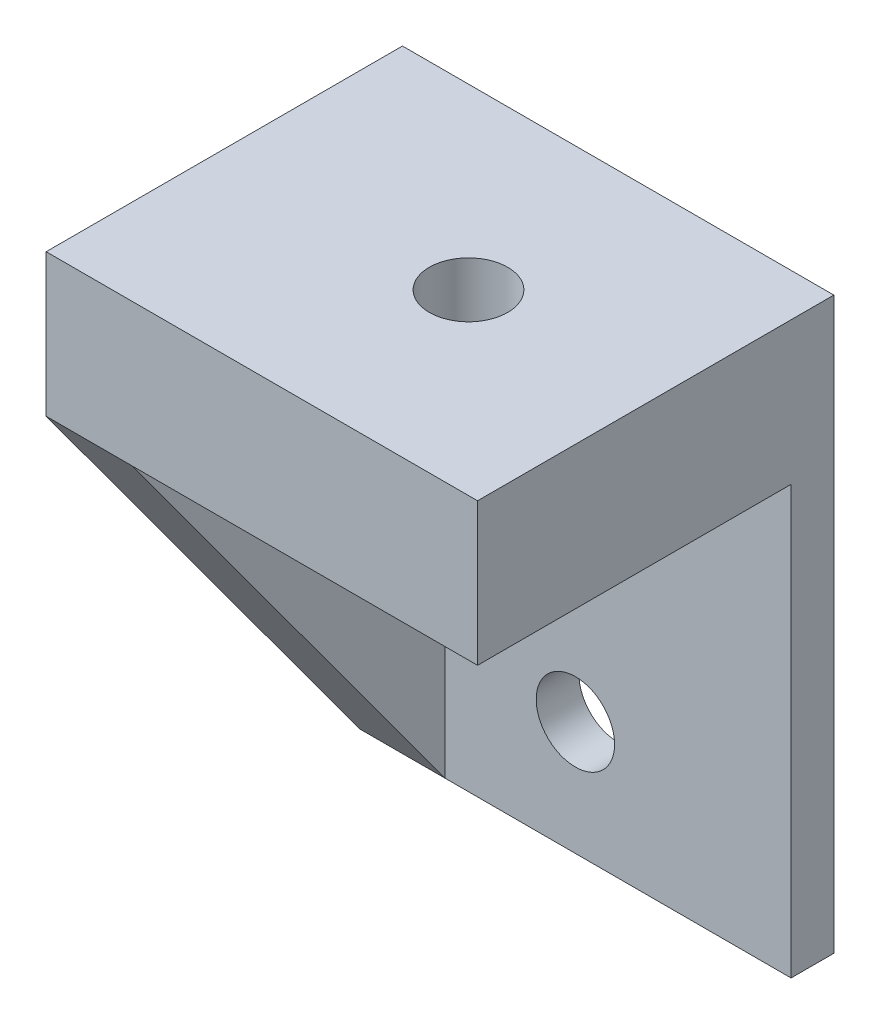
ISO-10303-21;
HEADER;
FILE_DESCRIPTION(('STEP AP214'),'2;1');
FILE_NAME('part.step','',(''),(''),'','','');
FILE_SCHEMA(('AUTOMOTIVE_DESIGN { 1 0 10303 214 1 1 1 1 }'));
ENDSEC;
DATA;
#1=APPLICATION_CONTEXT('core data for automotive mechanical design processes');
#2=APPLICATION_PROTOCOL_DEFINITION('international standard','automotive_design',2000,#1);
#3=PRODUCT_CONTEXT('',#1,'mechanical');
#4=PRODUCT('Part','Part','',(#3));
#5=PRODUCT_RELATED_PRODUCT_CATEGORY('part','',(#4));
#6=PRODUCT_DEFINITION_FORMATION('','',#4);
#7=PRODUCT_DEFINITION_CONTEXT('part definition',#1,'design');
#8=PRODUCT_DEFINITION('design','',#6,#7);
#9=PRODUCT_DEFINITION_SHAPE('','',#8);
#10=(LENGTH_UNIT() NAMED_UNIT(*) SI_UNIT(.MILLI.,.METRE.));
#11=(NAMED_UNIT(*) PLANE_ANGLE_UNIT() SI_UNIT($,.RADIAN.));
#12=(NAMED_UNIT(*) SI_UNIT($,.STERADIAN.) SOLID_ANGLE_UNIT());
#13=UNCERTAINTY_MEASURE_WITH_UNIT(LENGTH_MEASURE(1.E-05),#10,'distance_accuracy_value','');
#14=(GEOMETRIC_REPRESENTATION_CONTEXT(3) GLOBAL_UNCERTAINTY_ASSIGNED_CONTEXT((#13)) GLOBAL_UNIT_ASSIGNED_CONTEXT((#10,
#11,#12)) REPRESENTATION_CONTEXT('',''));
#15=CARTESIAN_POINT('',(0.,0.,0.));
#16=DIRECTION('',(0.,0.,1.));
#17=DIRECTION('',(1.,0.,0.));
#18=AXIS2_PLACEMENT_3D('',#15,#16,#17);
#19=CARTESIAN_POINT('',(33.7360752377383,0.,0.));
#20=DIRECTION('',(0.,-0.591363663627517,0.806404995855705));
#21=DIRECTION('',(0.,-0.806404995855705,-0.591363663627517));
#22=AXIS2_PLACEMENT_3D('',#19,#20,#21);
#23=PLANE('',#22);
#24=DIRECTION('',(0.,-0.806404995855705,-0.591363663627517));
#25=VECTOR('',#24,1.);
#26=CARTESIAN_POINT('',(3.,0.,0.));
#27=LINE('',#26,#25);
#28=CARTESIAN_POINT('',(3.,0.,0.));
#29=VERTEX_POINT('',#28);
#30=CARTESIAN_POINT('',(3.,-15.,-11.));
#31=VERTEX_POINT('',#30);
#32=EDGE_CURVE('E11',#29,#31,#27,.T.);
#33=ORIENTED_EDGE('',*,*,#32,.F.);
#34=DIRECTION('',(1.,0.,0.));
#35=VECTOR('',#34,1.);
#36=CARTESIAN_POINT('',(0.,0.,0.));
#37=LINE('',#36,#35);
#38=CARTESIAN_POINT('',(0.,0.,0.));
#39=VERTEX_POINT('',#38);
#40=EDGE_CURVE('E144',#39,#29,#37,.T.);
#41=ORIENTED_EDGE('',*,*,#40,.F.);
#42=DIRECTION('',(0.,0.806404995855705,0.591363663627517));
#43=VECTOR('',#42,1.);
#44=CARTESIAN_POINT('',(0.,0.,0.));
#45=LINE('',#44,#43);
#46=CARTESIAN_POINT('',(0.,-15.,-11.));
#47=VERTEX_POINT('',#46);
#48=EDGE_CURVE('E176',#47,#39,#45,.T.);
#49=ORIENTED_EDGE('',*,*,#48,.F.);
#50=DIRECTION('',(-1.,0.,0.));
#51=VECTOR('',#50,1.);
#52=CARTESIAN_POINT('',(15.135,-15.,-11.));
#53=LINE('',#52,#51);
#54=EDGE_CURVE('E116',#31,#47,#53,.T.);
#55=ORIENTED_EDGE('',*,*,#54,.F.);
#56=EDGE_LOOP('',(#33,#41,#49,#55));
#57=FACE_BOUND('',#56,.T.);
#58=ADVANCED_FACE('F42',(#57),#23,.T.);
#59=CARTESIAN_POINT('',(0.,5.,0.));
#60=DIRECTION('',(1.,0.,0.));
#61=DIRECTION('',(0.,0.,-1.));
#62=AXIS2_PLACEMENT_3D('',#59,#60,#61);
#63=PLANE('',#62);
#64=ORIENTED_EDGE('',*,*,#48,.T.);
#65=DIRECTION('',(0.,-1.,0.));
#66=VECTOR('',#65,1.);
#67=CARTESIAN_POINT('',(0.,5.,0.));
#68=LINE('',#67,#66);
#69=CARTESIAN_POINT('',(0.,5.,0.));
#70=VERTEX_POINT('',#69);
#71=EDGE_CURVE('E52',#70,#39,#68,.T.);
#72=ORIENTED_EDGE('',*,*,#71,.F.);
#73=DIRECTION('',(0.,0.,1.));
#74=VECTOR('',#73,1.);
#75=CARTESIAN_POINT('',(0.,5.,0.));
#76=LINE('',#75,#74);
#77=CARTESIAN_POINT('',(0.,5.,-12.5));
#78=VERTEX_POINT('',#77);
#79=EDGE_CURVE('E140',#78,#70,#76,.T.);
#80=ORIENTED_EDGE('',*,*,#79,.F.);
#81=DIRECTION('',(0.,-1.,0.));
#82=VECTOR('',#81,1.);
#83=CARTESIAN_POINT('',(0.,5.,-12.5));
#84=LINE('',#83,#82);
#85=CARTESIAN_POINT('',(0.,-15.,-12.5));
#86=VERTEX_POINT('',#85);
#87=EDGE_CURVE('E151',#78,#86,#84,.T.);
#88=ORIENTED_EDGE('',*,*,#87,.T.);
#89=DIRECTION('',(0.,0.,-1.));
#90=VECTOR('',#89,1.);
#91=CARTESIAN_POINT('',(0.,-15.,-11.));
#92=LINE('',#91,#90);
#93=EDGE_CURVE('E132',#47,#86,#92,.T.);
#94=ORIENTED_EDGE('',*,*,#93,.F.);
#95=EDGE_LOOP('',(#64,#72,#80,#88,#94));
#96=FACE_BOUND('',#95,.T.);
#97=ADVANCED_FACE('F44',(#96),#63,.F.);
#98=CARTESIAN_POINT('',(0.,5.,0.));
#99=DIRECTION('',(0.,0.,-1.));
#100=DIRECTION('',(-1.,0.,0.));
#101=AXIS2_PLACEMENT_3D('',#98,#99,#100);
#102=PLANE('',#101);
#103=ORIENTED_EDGE('',*,*,#40,.T.);
#104=CARTESIAN_POINT('',(15.135,0.,0.));
#105=VERTEX_POINT('',#104);
#106=EDGE_CURVE('E136',#29,#105,#37,.T.);
#107=ORIENTED_EDGE('',*,*,#106,.T.);
#108=DIRECTION('',(0.,-1.,0.));
#109=VECTOR('',#108,1.);
#110=CARTESIAN_POINT('',(15.135,5.,0.));
#111=LINE('',#110,#109);
#112=CARTESIAN_POINT('',(15.135,5.,0.));
#113=VERTEX_POINT('',#112);
#114=EDGE_CURVE('E160',#113,#105,#111,.T.);
#115=ORIENTED_EDGE('',*,*,#114,.F.);
#116=DIRECTION('',(1.,0.,0.));
#117=VECTOR('',#116,1.);
#118=CARTESIAN_POINT('',(0.,5.,0.));
#119=LINE('',#118,#117);
#120=EDGE_CURVE('E143',#70,#113,#119,.T.);
#121=ORIENTED_EDGE('',*,*,#120,.F.);
#122=ORIENTED_EDGE('',*,*,#71,.T.);
#123=EDGE_LOOP('',(#103,#107,#115,#121,#122));
#124=FACE_BOUND('',#123,.T.);
#125=ADVANCED_FACE('F168',(#124),#102,.F.);
#126=CARTESIAN_POINT('',(15.135,5.,0.));
#127=DIRECTION('',(-1.,0.,0.));
#128=DIRECTION('',(0.,0.,1.));
#129=AXIS2_PLACEMENT_3D('',#126,#127,#128);
#130=PLANE('',#129);
#131=DIRECTION('',(0.,0.,-1.));
#132=VECTOR('',#131,1.);
#133=CARTESIAN_POINT('',(15.135,0.,0.));
#134=LINE('',#133,#132);
#135=CARTESIAN_POINT('',(15.135,0.,-11.));
#136=VERTEX_POINT('',#135);
#137=EDGE_CURVE('E123',#105,#136,#134,.T.);
#138=ORIENTED_EDGE('',*,*,#137,.T.);
#139=DIRECTION('',(0.,-1.,0.));
#140=VECTOR('',#139,1.);
#141=CARTESIAN_POINT('',(15.135,5.,-11.));
#142=LINE('',#141,#140);
#143=CARTESIAN_POINT('',(15.135,-15.,-11.));
#144=VERTEX_POINT('',#143);
#145=EDGE_CURVE('E107',#136,#144,#142,.T.);
#146=ORIENTED_EDGE('',*,*,#145,.T.);
#147=DIRECTION('',(0.,0.,-1.));
#148=VECTOR('',#147,1.);
#149=CARTESIAN_POINT('',(15.135,-15.,-11.));
#150=LINE('',#149,#148);
#151=CARTESIAN_POINT('',(15.135,-15.,-12.5));
#152=VERTEX_POINT('',#151);
#153=EDGE_CURVE('E115',#144,#152,#150,.T.);
#154=ORIENTED_EDGE('',*,*,#153,.T.);
#155=DIRECTION('',(0.,-1.,0.));
#156=VECTOR('',#155,1.);
#157=CARTESIAN_POINT('',(15.135,5.,-12.5));
#158=LINE('',#157,#156);
#159=CARTESIAN_POINT('',(15.135,5.,-12.5));
#160=VERTEX_POINT('',#159);
#161=EDGE_CURVE('E157',#160,#152,#158,.T.);
#162=ORIENTED_EDGE('',*,*,#161,.F.);
#163=DIRECTION('',(0.,0.,-1.));
#164=VECTOR('',#163,1.);
#165=CARTESIAN_POINT('',(15.135,5.,0.));
#166=LINE('',#165,#164);
#167=EDGE_CURVE('E64',#113,#160,#166,.T.);
#168=ORIENTED_EDGE('',*,*,#167,.F.);
#169=ORIENTED_EDGE('',*,*,#114,.T.);
#170=EDGE_LOOP('',(#138,#146,#154,#162,#168,#169));
#171=FACE_BOUND('',#170,.T.);
#172=ADVANCED_FACE('F120',(#171),#130,.F.);
#173=CARTESIAN_POINT('',(0.,5.,-12.5));
#174=DIRECTION('',(0.,0.,1.));
#175=DIRECTION('',(1.,0.,0.));
#176=AXIS2_PLACEMENT_3D('',#173,#174,#175);
#177=PLANE('',#176);
#178=CARTESIAN_POINT('',(7.5675,-11.,-12.5));
#179=DIRECTION('',(0.,0.,1.));
#180=DIRECTION('',(1.,0.,0.));
#181=AXIS2_PLACEMENT_3D('',#178,#179,#180);
#182=CIRCLE('',#181,1.375);
#183=CARTESIAN_POINT('',(8.9425,-11.,-12.5));
#184=VERTEX_POINT('',#183);
#185=EDGE_CURVE('E192',#184,#184,#182,.T.);
#186=ORIENTED_EDGE('',*,*,#185,.T.);
#187=EDGE_LOOP('',(#186));
#188=FACE_BOUND('',#187,.T.);
#189=CARTESIAN_POINT('',(7.5675,-4.,-12.5));
#190=DIRECTION('',(0.,0.,1.));
#191=DIRECTION('',(1.,0.,0.));
#192=AXIS2_PLACEMENT_3D('',#189,#190,#191);
#193=CIRCLE('',#192,1.375);
#194=CARTESIAN_POINT('',(8.9425,-4.,-12.5));
#195=VERTEX_POINT('',#194);
#196=EDGE_CURVE('E196',#195,#195,#193,.T.);
#197=ORIENTED_EDGE('',*,*,#196,.T.);
#198=EDGE_LOOP('',(#197));
#199=FACE_BOUND('',#198,.T.);
#200=ORIENTED_EDGE('',*,*,#161,.T.);
#201=DIRECTION('',(-1.,0.,0.));
#202=VECTOR('',#201,1.);
#203=CARTESIAN_POINT('',(15.135,-15.,-12.5));
#204=LINE('',#203,#202);
#205=EDGE_CURVE('E130',#152,#86,#204,.T.);
#206=ORIENTED_EDGE('',*,*,#205,.T.);
#207=ORIENTED_EDGE('',*,*,#87,.F.);
#208=DIRECTION('',(-1.,0.,0.));
#209=VECTOR('',#208,1.);
#210=CARTESIAN_POINT('',(0.,5.,-12.5));
#211=LINE('',#210,#209);
#212=EDGE_CURVE('E59',#160,#78,#211,.T.);
#213=ORIENTED_EDGE('',*,*,#212,.F.);
#214=EDGE_LOOP('',(#200,#206,#207,#213));
#215=FACE_BOUND('',#214,.T.);
#216=ADVANCED_FACE('F256',(#188,#199,#215),#177,.F.);
#217=CARTESIAN_POINT('',(0.,5.,0.));
#218=DIRECTION('',(0.,-1.,0.));
#219=DIRECTION('',(0.,0.,-1.));
#220=AXIS2_PLACEMENT_3D('',#217,#218,#219);
#221=PLANE('',#220);
#222=CARTESIAN_POINT('',(8.5675,5.,-6.25));
#223=DIRECTION('',(0.,1.,0.));
#224=DIRECTION('',(0.,0.,1.));
#225=AXIS2_PLACEMENT_3D('',#222,#223,#224);
#226=CIRCLE('',#225,1.375);
#227=CARTESIAN_POINT('',(8.5675,5.,-4.875));
#228=VERTEX_POINT('',#227);
#229=EDGE_CURVE('E125',#228,#228,#226,.T.);
#230=ORIENTED_EDGE('',*,*,#229,.F.);
#231=EDGE_LOOP('',(#230));
#232=FACE_BOUND('',#231,.T.);
#233=ORIENTED_EDGE('',*,*,#79,.T.);
#234=ORIENTED_EDGE('',*,*,#120,.T.);
#235=ORIENTED_EDGE('',*,*,#167,.T.);
#236=ORIENTED_EDGE('',*,*,#212,.T.);
#237=EDGE_LOOP('',(#233,#234,#235,#236));
#238=FACE_BOUND('',#237,.T.);
#239=ADVANCED_FACE('F253',(#232,#238),#221,.F.);
#240=CARTESIAN_POINT('',(15.135,-15.,-11.));
#241=DIRECTION('',(0.,-1.,0.));
#242=DIRECTION('',(0.,0.,-1.));
#243=AXIS2_PLACEMENT_3D('',#240,#241,#242);
#244=PLANE('',#243);
#245=ORIENTED_EDGE('',*,*,#205,.F.);
#246=ORIENTED_EDGE('',*,*,#153,.F.);
#247=EDGE_CURVE('E103',#144,#31,#53,.T.);
#248=ORIENTED_EDGE('',*,*,#247,.T.);
#249=ORIENTED_EDGE('',*,*,#54,.T.);
#250=ORIENTED_EDGE('',*,*,#93,.T.);
#251=EDGE_LOOP('',(#245,#246,#248,#249,#250));
#252=FACE_BOUND('',#251,.T.);
#253=ADVANCED_FACE('F127',(#252),#244,.T.);
#254=CARTESIAN_POINT('',(3.,0.,-11.));
#255=DIRECTION('',(-1.,0.,0.));
#256=DIRECTION('',(0.,-1.,0.));
#257=AXIS2_PLACEMENT_3D('',#254,#255,#256);
#258=PLANE('',#257);
#259=ORIENTED_EDGE('',*,*,#32,.T.);
#260=DIRECTION('',(0.,-1.,0.));
#261=VECTOR('',#260,1.);
#262=CARTESIAN_POINT('',(3.,0.,-11.));
#263=LINE('',#262,#261);
#264=CARTESIAN_POINT('',(3.,0.,-11.));
#265=VERTEX_POINT('',#264);
#266=EDGE_CURVE('E110',#265,#31,#263,.T.);
#267=ORIENTED_EDGE('',*,*,#266,.F.);
#268=DIRECTION('',(0.,0.,1.));
#269=VECTOR('',#268,1.);
#270=CARTESIAN_POINT('',(3.,0.,-11.));
#271=LINE('',#270,#269);
#272=EDGE_CURVE('E179',#265,#29,#271,.T.);
#273=ORIENTED_EDGE('',*,*,#272,.T.);
#274=EDGE_LOOP('',(#259,#267,#273));
#275=FACE_BOUND('',#274,.T.);
#276=ADVANCED_FACE('F249',(#275),#258,.F.);
#277=CARTESIAN_POINT('',(3.,0.,-11.));
#278=DIRECTION('',(0.,1.,0.));
#279=DIRECTION('',(0.,0.,1.));
#280=AXIS2_PLACEMENT_3D('',#277,#278,#279);
#281=PLANE('',#280);
#282=CARTESIAN_POINT('',(8.5675,0.,-6.25));
#283=DIRECTION('',(0.,1.,0.));
#284=DIRECTION('',(0.,0.,1.));
#285=AXIS2_PLACEMENT_3D('',#282,#283,#284);
#286=CIRCLE('',#285,1.375);
#287=CARTESIAN_POINT('',(8.5675,0.,-4.875));
#288=VERTEX_POINT('',#287);
#289=EDGE_CURVE('E46',#288,#288,#286,.T.);
#290=ORIENTED_EDGE('',*,*,#289,.T.);
#291=EDGE_LOOP('',(#290));
#292=FACE_BOUND('',#291,.T.);
#293=ORIENTED_EDGE('',*,*,#106,.F.);
#294=ORIENTED_EDGE('',*,*,#272,.F.);
#295=DIRECTION('',(-1.,0.,0.));
#296=VECTOR('',#295,1.);
#297=CARTESIAN_POINT('',(3.,0.,-11.));
#298=LINE('',#297,#296);
#299=EDGE_CURVE('E185',#136,#265,#298,.T.);
#300=ORIENTED_EDGE('',*,*,#299,.F.);
#301=ORIENTED_EDGE('',*,*,#137,.F.);
#302=EDGE_LOOP('',(#293,#294,#300,#301));
#303=FACE_BOUND('',#302,.T.);
#304=ADVANCED_FACE('F227',(#292,#303),#281,.F.);
#305=CARTESIAN_POINT('',(0.,0.,-11.));
#306=DIRECTION('',(0.,0.,1.));
#307=DIRECTION('',(1.,0.,0.));
#308=AXIS2_PLACEMENT_3D('',#305,#306,#307);
#309=PLANE('',#308);
#310=CARTESIAN_POINT('',(7.5675,-11.,-11.));
#311=DIRECTION('',(0.,0.,1.));
#312=DIRECTION('',(1.,0.,0.));
#313=AXIS2_PLACEMENT_3D('',#310,#311,#312);
#314=CIRCLE('',#313,1.375);
#315=CARTESIAN_POINT('',(8.9425,-11.,-11.));
#316=VERTEX_POINT('',#315);
#317=EDGE_CURVE('E200',#316,#316,#314,.T.);
#318=ORIENTED_EDGE('',*,*,#317,.F.);
#319=EDGE_LOOP('',(#318));
#320=FACE_BOUND('',#319,.T.);
#321=CARTESIAN_POINT('',(7.5675,-4.,-11.));
#322=DIRECTION('',(0.,0.,1.));
#323=DIRECTION('',(1.,0.,0.));
#324=AXIS2_PLACEMENT_3D('',#321,#322,#323);
#325=CIRCLE('',#324,1.375);
#326=CARTESIAN_POINT('',(8.9425,-4.,-11.));
#327=VERTEX_POINT('',#326);
#328=EDGE_CURVE('E201',#327,#327,#325,.T.);
#329=ORIENTED_EDGE('',*,*,#328,.F.);
#330=EDGE_LOOP('',(#329));
#331=FACE_BOUND('',#330,.T.);
#332=ORIENTED_EDGE('',*,*,#266,.T.);
#333=ORIENTED_EDGE('',*,*,#247,.F.);
#334=ORIENTED_EDGE('',*,*,#145,.F.);
#335=ORIENTED_EDGE('',*,*,#299,.T.);
#336=EDGE_LOOP('',(#332,#333,#334,#335));
#337=FACE_BOUND('',#336,.T.);
#338=ADVANCED_FACE('F105',(#320,#331,#337),#309,.T.);
#339=CARTESIAN_POINT('',(7.5675,-4.,-13.));
#340=DIRECTION('',(0.,0.,1.));
#341=DIRECTION('',(1.,0.,0.));
#342=AXIS2_PLACEMENT_3D('',#339,#340,#341);
#343=CYLINDRICAL_SURFACE('',#342,1.375);
#344=ORIENTED_EDGE('',*,*,#328,.T.);
#345=EDGE_LOOP('',(#344));
#346=FACE_BOUND('',#345,.T.);
#347=ORIENTED_EDGE('',*,*,#196,.F.);
#348=EDGE_LOOP('',(#347));
#349=FACE_BOUND('',#348,.T.);
#350=ADVANCED_FACE('F238',(#346,#349),#343,.F.);
#351=CARTESIAN_POINT('',(7.5675,-11.,-13.));
#352=DIRECTION('',(0.,0.,1.));
#353=DIRECTION('',(1.,0.,0.));
#354=AXIS2_PLACEMENT_3D('',#351,#352,#353);
#355=CYLINDRICAL_SURFACE('',#354,1.375);
#356=ORIENTED_EDGE('',*,*,#317,.T.);
#357=EDGE_LOOP('',(#356));
#358=FACE_BOUND('',#357,.T.);
#359=ORIENTED_EDGE('',*,*,#185,.F.);
#360=EDGE_LOOP('',(#359));
#361=FACE_BOUND('',#360,.T.);
#362=ADVANCED_FACE('F232',(#358,#361),#355,.F.);
#363=CARTESIAN_POINT('',(8.5675,-0.75,-6.25));
#364=DIRECTION('',(0.,1.,0.));
#365=DIRECTION('',(0.,0.,1.));
#366=AXIS2_PLACEMENT_3D('',#363,#364,#365);
#367=CYLINDRICAL_SURFACE('',#366,1.375);
#368=ORIENTED_EDGE('',*,*,#229,.T.);
#369=EDGE_LOOP('',(#368));
#370=FACE_BOUND('',#369,.T.);
#371=ORIENTED_EDGE('',*,*,#289,.F.);
#372=EDGE_LOOP('',(#371));
#373=FACE_BOUND('',#372,.T.);
#374=ADVANCED_FACE('F230',(#370,#373),#367,.F.);
#375=CLOSED_SHELL('',(#58,#97,#125,#172,#216,#239,#253,#276,#304,#338,#350,#362,#374));
#376=MANIFOLD_SOLID_BREP('B2',#375);
#377=ADVANCED_BREP_SHAPE_REPRESENTATION('',(#18,#376),#14);
#378=SHAPE_DEFINITION_REPRESENTATION(#9,#377);
ENDSEC;
END-ISO-10303-21;
